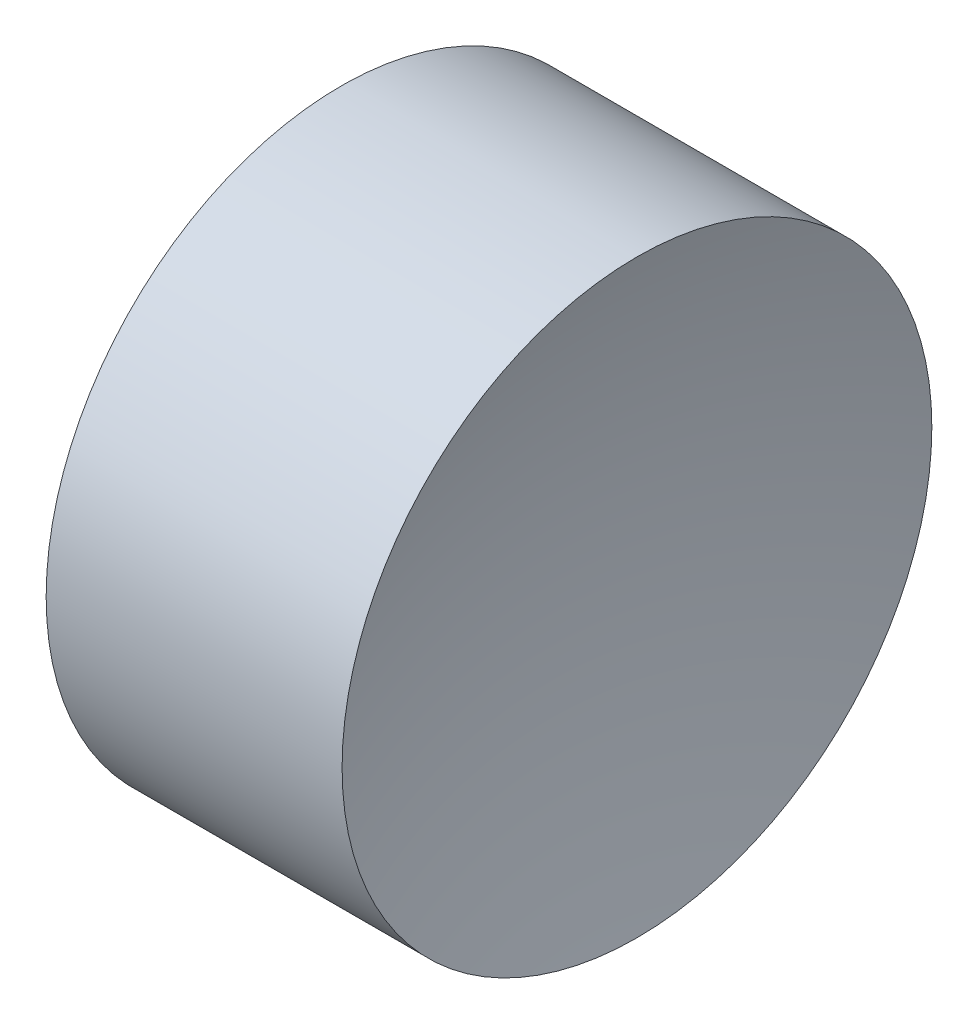
ISO-10303-21;
HEADER;
FILE_DESCRIPTION(('STEP AP214'),'2;1');
FILE_NAME('part.step','',(''),(''),'','','');
FILE_SCHEMA(('AUTOMOTIVE_DESIGN { 1 0 10303 214 1 1 1 1 }'));
ENDSEC;
DATA;
#1=APPLICATION_CONTEXT('core data for automotive mechanical design processes');
#2=APPLICATION_PROTOCOL_DEFINITION('international standard','automotive_design',2000,#1);
#3=PRODUCT_CONTEXT('',#1,'mechanical');
#4=PRODUCT('Part','Part','',(#3));
#5=PRODUCT_RELATED_PRODUCT_CATEGORY('part','',(#4));
#6=PRODUCT_DEFINITION_FORMATION('','',#4);
#7=PRODUCT_DEFINITION_CONTEXT('part definition',#1,'design');
#8=PRODUCT_DEFINITION('design','',#6,#7);
#9=PRODUCT_DEFINITION_SHAPE('','',#8);
#10=(LENGTH_UNIT() NAMED_UNIT(*) SI_UNIT(.MILLI.,.METRE.));
#11=(NAMED_UNIT(*) PLANE_ANGLE_UNIT() SI_UNIT($,.RADIAN.));
#12=(NAMED_UNIT(*) SI_UNIT($,.STERADIAN.) SOLID_ANGLE_UNIT());
#13=UNCERTAINTY_MEASURE_WITH_UNIT(LENGTH_MEASURE(1.E-05),#10,'distance_accuracy_value','');
#14=(GEOMETRIC_REPRESENTATION_CONTEXT(3) GLOBAL_UNCERTAINTY_ASSIGNED_CONTEXT((#13)) GLOBAL_UNIT_ASSIGNED_CONTEXT((#10,
#11,#12)) REPRESENTATION_CONTEXT('',''));
#15=CARTESIAN_POINT('',(0.,0.,0.));
#16=DIRECTION('',(0.,0.,1.));
#17=DIRECTION('',(1.,0.,0.));
#18=AXIS2_PLACEMENT_3D('',#15,#16,#17);
#19=CARTESIAN_POINT('',(19.670595084783,6.51556304570152,0.));
#20=DIRECTION('',(-1.,0.,0.));
#21=DIRECTION('',(0.,1.,0.));
#22=AXIS2_PLACEMENT_3D('',#19,#20,#21);
#23=SPHERICAL_SURFACE('',#22,6.88);
#24=CARTESIAN_POINT('',(13.0877081800883,6.51556304570152,0.));
#25=DIRECTION('',(-1.,0.,0.));
#26=DIRECTION('',(0.,0.,1.));
#27=AXIS2_PLACEMENT_3D('',#24,#25,#26);
#28=CIRCLE('',#27,2.);
#29=CARTESIAN_POINT('',(13.0877081800883,6.51556304570152,2.));
#30=VERTEX_POINT('',#29);
#31=EDGE_CURVE('E10',#30,#30,#28,.T.);
#32=ORIENTED_EDGE('',*,*,#31,.F.);
#33=EDGE_LOOP('',(#32));
#34=FACE_BOUND('',#33,.T.);
#35=ADVANCED_FACE('F35',(#34),#23,.F.);
#36=CARTESIAN_POINT('',(10.5782359612221,6.51556304570152,0.));
#37=DIRECTION('',(-1.,0.,0.));
#38=DIRECTION('',(0.,0.,1.));
#39=AXIS2_PLACEMENT_3D('',#36,#37,#38);
#40=CYLINDRICAL_SURFACE('',#39,2.);
#41=CARTESIAN_POINT('',(11.080595084783,6.51556304570152,0.));
#42=DIRECTION('',(-1.,0.,0.));
#43=DIRECTION('',(0.,0.,1.));
#44=AXIS2_PLACEMENT_3D('',#41,#42,#43);
#45=CIRCLE('',#44,2.);
#46=CARTESIAN_POINT('',(11.080595084783,6.51556304570152,2.));
#47=VERTEX_POINT('',#46);
#48=EDGE_CURVE('E41',#47,#47,#45,.T.);
#49=ORIENTED_EDGE('',*,*,#48,.F.);
#50=EDGE_LOOP('',(#49));
#51=FACE_BOUND('',#50,.T.);
#52=ORIENTED_EDGE('',*,*,#31,.T.);
#53=EDGE_LOOP('',(#52));
#54=FACE_BOUND('',#53,.T.);
#55=ADVANCED_FACE('F49',(#51,#54),#40,.T.);
#56=CARTESIAN_POINT('',(11.080595084783,6.51556304570152,0.));
#57=DIRECTION('',(1.,0.,0.));
#58=DIRECTION('',(0.,0.,-1.));
#59=AXIS2_PLACEMENT_3D('',#56,#57,#58);
#60=PLANE('',#59);
#61=ORIENTED_EDGE('',*,*,#48,.T.);
#62=EDGE_LOOP('',(#61));
#63=FACE_BOUND('',#62,.T.);
#64=ADVANCED_FACE('F47',(#63),#60,.F.);
#65=CLOSED_SHELL('',(#35,#55,#64));
#66=MANIFOLD_SOLID_BREP('B2',#65);
#67=ADVANCED_BREP_SHAPE_REPRESENTATION('',(#18,#66),#14);
#68=SHAPE_DEFINITION_REPRESENTATION(#9,#67);
ENDSEC;
END-ISO-10303-21;
